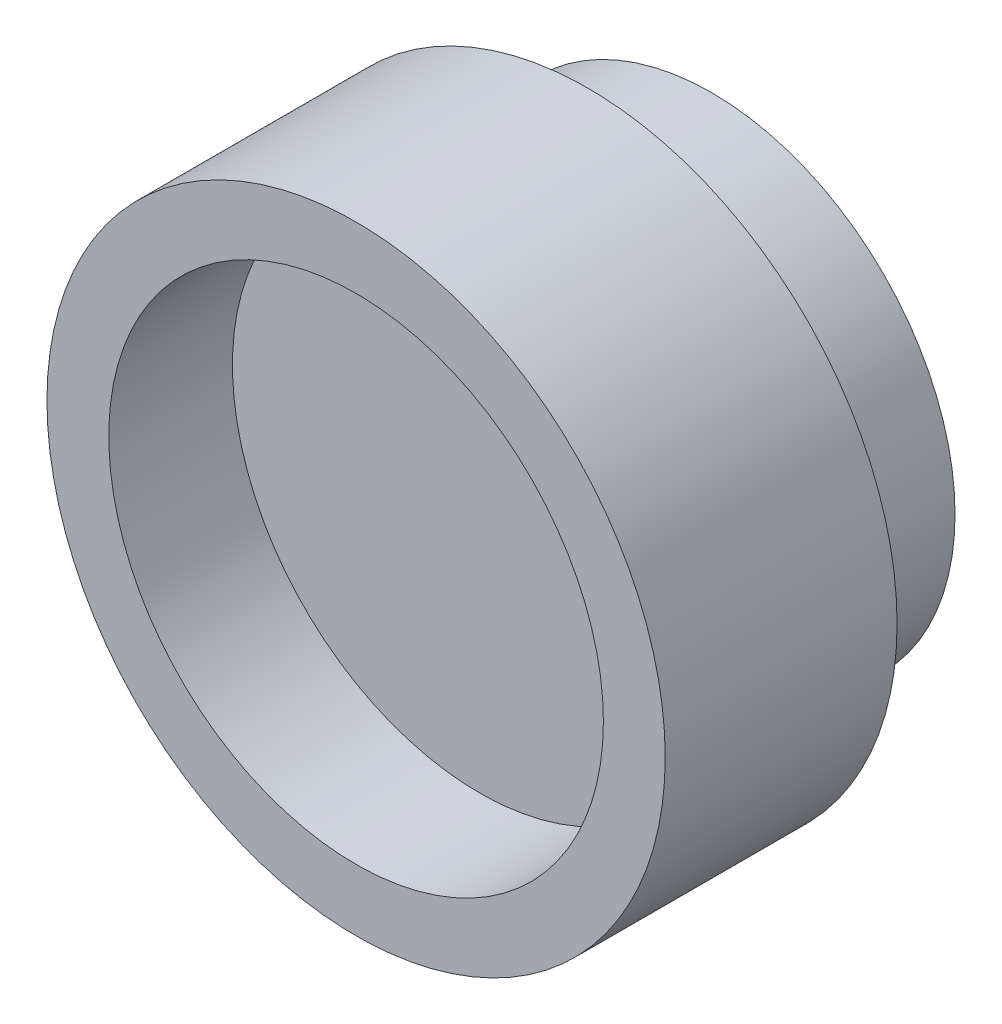
ISO-10303-21;
HEADER;
FILE_DESCRIPTION(('STEP AP214'),'2;1');
FILE_NAME('part.step','',(''),(''),'','','');
FILE_SCHEMA(('AUTOMOTIVE_DESIGN { 1 0 10303 214 1 1 1 1 }'));
ENDSEC;
DATA;
#1=APPLICATION_CONTEXT('core data for automotive mechanical design processes');
#2=APPLICATION_PROTOCOL_DEFINITION('international standard','automotive_design',2000,#1);
#3=PRODUCT_CONTEXT('',#1,'mechanical');
#4=PRODUCT('Part','Part','',(#3));
#5=PRODUCT_RELATED_PRODUCT_CATEGORY('part','',(#4));
#6=PRODUCT_DEFINITION_FORMATION('','',#4);
#7=PRODUCT_DEFINITION_CONTEXT('part definition',#1,'design');
#8=PRODUCT_DEFINITION('design','',#6,#7);
#9=PRODUCT_DEFINITION_SHAPE('','',#8);
#10=(LENGTH_UNIT() NAMED_UNIT(*) SI_UNIT(.MILLI.,.METRE.));
#11=(NAMED_UNIT(*) PLANE_ANGLE_UNIT() SI_UNIT($,.RADIAN.));
#12=(NAMED_UNIT(*) SI_UNIT($,.STERADIAN.) SOLID_ANGLE_UNIT());
#13=UNCERTAINTY_MEASURE_WITH_UNIT(LENGTH_MEASURE(1.E-05),#10,'distance_accuracy_value','');
#14=(GEOMETRIC_REPRESENTATION_CONTEXT(3) GLOBAL_UNCERTAINTY_ASSIGNED_CONTEXT((#13)) GLOBAL_UNIT_ASSIGNED_CONTEXT((#10,
#11,#12)) REPRESENTATION_CONTEXT('',''));
#15=CARTESIAN_POINT('',(0.,0.,0.));
#16=DIRECTION('',(0.,0.,1.));
#17=DIRECTION('',(1.,0.,0.));
#18=AXIS2_PLACEMENT_3D('',#15,#16,#17);
#19=CARTESIAN_POINT('',(0.,0.,23.));
#20=DIRECTION('',(0.,0.,-1.));
#21=DIRECTION('',(-1.,0.,0.));
#22=AXIS2_PLACEMENT_3D('',#19,#20,#21);
#23=CYLINDRICAL_SURFACE('',#22,15.75);
#24=CARTESIAN_POINT('',(0.,0.,0.));
#25=DIRECTION('',(0.,0.,1.));
#26=DIRECTION('',(1.,0.,0.));
#27=AXIS2_PLACEMENT_3D('',#24,#25,#26);
#28=CIRCLE('',#27,15.75);
#29=CARTESIAN_POINT('',(15.75,0.,0.));
#30=VERTEX_POINT('',#29);
#31=EDGE_CURVE('E43',#30,#30,#28,.T.);
#32=ORIENTED_EDGE('',*,*,#31,.T.);
#33=EDGE_LOOP('',(#32));
#34=FACE_BOUND('',#33,.T.);
#35=CARTESIAN_POINT('',(0.,0.,8.));
#36=DIRECTION('',(0.,0.,1.));
#37=DIRECTION('',(1.,0.,0.));
#38=AXIS2_PLACEMENT_3D('',#35,#36,#37);
#39=CIRCLE('',#38,15.75);
#40=CARTESIAN_POINT('',(15.75,0.,8.));
#41=VERTEX_POINT('',#40);
#42=EDGE_CURVE('E11',#41,#41,#39,.T.);
#43=ORIENTED_EDGE('',*,*,#42,.F.);
#44=EDGE_LOOP('',(#43));
#45=FACE_BOUND('',#44,.T.);
#46=ADVANCED_FACE('F37',(#34,#45),#23,.T.);
#47=CARTESIAN_POINT('',(0.,0.,0.));
#48=DIRECTION('',(0.,0.,1.));
#49=DIRECTION('',(1.,0.,0.));
#50=AXIS2_PLACEMENT_3D('',#47,#48,#49);
#51=PLANE('',#50);
#52=ORIENTED_EDGE('',*,*,#31,.F.);
#53=EDGE_LOOP('',(#52));
#54=FACE_BOUND('',#53,.T.);
#55=ADVANCED_FACE('F85',(#54),#51,.F.);
#56=CARTESIAN_POINT('',(0.,0.,8.));
#57=DIRECTION('',(0.,0.,1.));
#58=DIRECTION('',(1.,0.,0.));
#59=AXIS2_PLACEMENT_3D('',#56,#57,#58);
#60=PLANE('',#59);
#61=CARTESIAN_POINT('',(0.,0.,8.));
#62=DIRECTION('',(0.,0.,1.));
#63=DIRECTION('',(1.,0.,0.));
#64=AXIS2_PLACEMENT_3D('',#61,#62,#63);
#65=CIRCLE('',#64,20.);
#66=CARTESIAN_POINT('',(20.,0.,8.));
#67=VERTEX_POINT('',#66);
#68=EDGE_CURVE('E47',#67,#67,#65,.F.);
#69=ORIENTED_EDGE('',*,*,#68,.T.);
#70=EDGE_LOOP('',(#69));
#71=FACE_BOUND('',#70,.T.);
#72=ORIENTED_EDGE('',*,*,#42,.T.);
#73=EDGE_LOOP('',(#72));
#74=FACE_BOUND('',#73,.T.);
#75=ADVANCED_FACE('F79',(#71,#74),#60,.F.);
#76=CARTESIAN_POINT('',(0.,0.,-56.5685424949238));
#77=DIRECTION('',(0.,0.,1.));
#78=DIRECTION('',(1.,0.,0.));
#79=AXIS2_PLACEMENT_3D('',#76,#77,#78);
#80=CYLINDRICAL_SURFACE('',#79,20.);
#81=ORIENTED_EDGE('',*,*,#68,.F.);
#82=EDGE_LOOP('',(#81));
#83=FACE_BOUND('',#82,.T.);
#84=CARTESIAN_POINT('',(0.,0.,23.));
#85=DIRECTION('',(0.,0.,1.));
#86=DIRECTION('',(1.,0.,0.));
#87=AXIS2_PLACEMENT_3D('',#84,#85,#86);
#88=CIRCLE('',#87,20.);
#89=CARTESIAN_POINT('',(20.,0.,23.));
#90=VERTEX_POINT('',#89);
#91=EDGE_CURVE('E51',#90,#90,#88,.T.);
#92=ORIENTED_EDGE('',*,*,#91,.F.);
#93=EDGE_LOOP('',(#92));
#94=FACE_BOUND('',#93,.T.);
#95=ADVANCED_FACE('F74',(#83,#94),#80,.T.);
#96=CARTESIAN_POINT('',(0.,0.,23.));
#97=DIRECTION('',(0.,0.,1.));
#98=DIRECTION('',(1.,0.,0.));
#99=AXIS2_PLACEMENT_3D('',#96,#97,#98);
#100=PLANE('',#99);
#101=CARTESIAN_POINT('',(0.,0.,23.));
#102=DIRECTION('',(0.,0.,1.));
#103=DIRECTION('',(1.,0.,0.));
#104=AXIS2_PLACEMENT_3D('',#101,#102,#103);
#105=CIRCLE('',#104,16.);
#106=CARTESIAN_POINT('',(16.,0.,23.));
#107=VERTEX_POINT('',#106);
#108=EDGE_CURVE('E57',#107,#107,#105,.T.);
#109=ORIENTED_EDGE('',*,*,#108,.F.);
#110=EDGE_LOOP('',(#109));
#111=FACE_BOUND('',#110,.T.);
#112=ORIENTED_EDGE('',*,*,#91,.T.);
#113=EDGE_LOOP('',(#112));
#114=FACE_BOUND('',#113,.T.);
#115=ADVANCED_FACE('F68',(#111,#114),#100,.T.);
#116=CARTESIAN_POINT('',(0.,0.,15.));
#117=DIRECTION('',(0.,0.,1.));
#118=DIRECTION('',(1.,0.,0.));
#119=AXIS2_PLACEMENT_3D('',#116,#117,#118);
#120=CYLINDRICAL_SURFACE('',#119,16.);
#121=CARTESIAN_POINT('',(0.,0.,15.));
#122=DIRECTION('',(0.,0.,1.));
#123=DIRECTION('',(1.,0.,0.));
#124=AXIS2_PLACEMENT_3D('',#121,#122,#123);
#125=CIRCLE('',#124,16.);
#126=CARTESIAN_POINT('',(16.,0.,15.));
#127=VERTEX_POINT('',#126);
#128=EDGE_CURVE('E56',#127,#127,#125,.T.);
#129=ORIENTED_EDGE('',*,*,#128,.F.);
#130=EDGE_LOOP('',(#129));
#131=FACE_BOUND('',#130,.T.);
#132=ORIENTED_EDGE('',*,*,#108,.T.);
#133=EDGE_LOOP('',(#132));
#134=FACE_BOUND('',#133,.T.);
#135=ADVANCED_FACE('F65',(#131,#134),#120,.F.);
#136=CARTESIAN_POINT('',(0.,0.,15.));
#137=DIRECTION('',(0.,0.,1.));
#138=DIRECTION('',(1.,0.,0.));
#139=AXIS2_PLACEMENT_3D('',#136,#137,#138);
#140=PLANE('',#139);
#141=ORIENTED_EDGE('',*,*,#128,.T.);
#142=EDGE_LOOP('',(#141));
#143=FACE_BOUND('',#142,.T.);
#144=ADVANCED_FACE('F63',(#143),#140,.T.);
#145=CLOSED_SHELL('',(#46,#55,#75,#95,#115,#135,#144));
#146=MANIFOLD_SOLID_BREP('B2',#145);
#147=ADVANCED_BREP_SHAPE_REPRESENTATION('',(#18,#146),#14);
#148=SHAPE_DEFINITION_REPRESENTATION(#9,#147);
ENDSEC;
END-ISO-10303-21;
